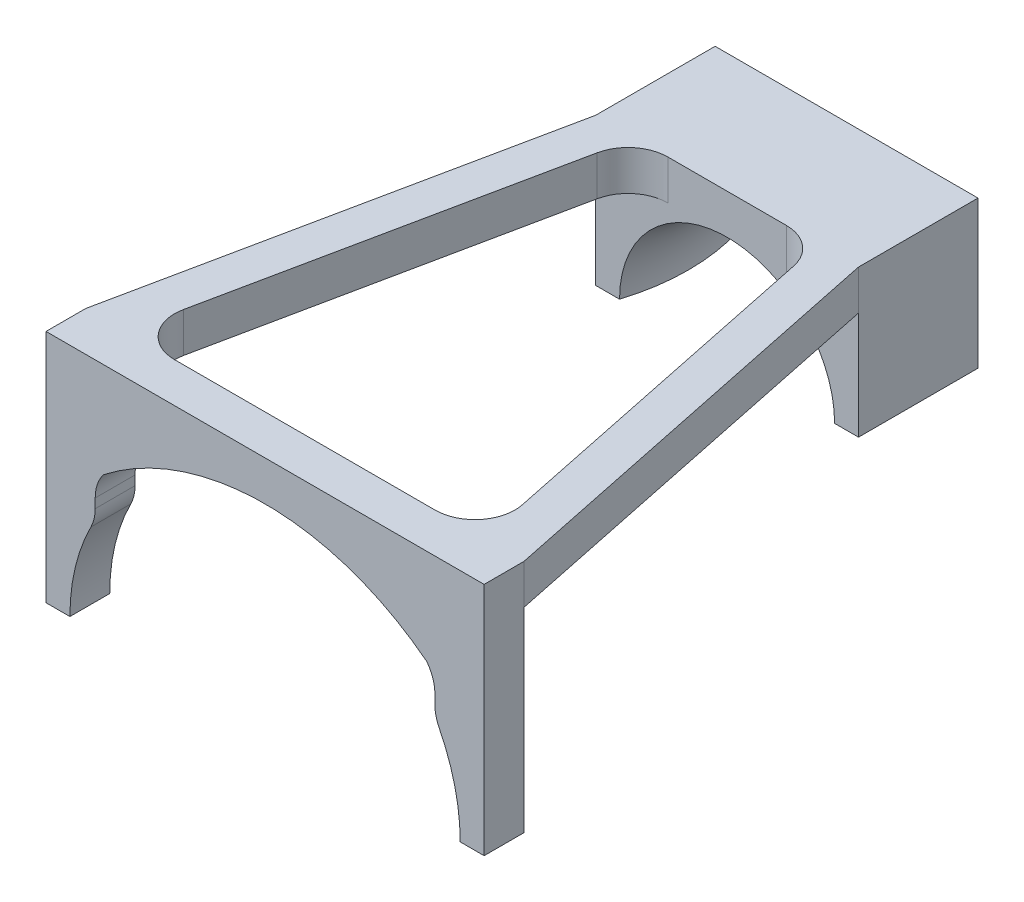
ISO-10303-21;
HEADER;
FILE_DESCRIPTION(('STEP AP214'),'2;1');
FILE_NAME('part.step','',(''),(''),'','','');
FILE_SCHEMA(('AUTOMOTIVE_DESIGN { 1 0 10303 214 1 1 1 1 }'));
ENDSEC;
DATA;
#1=APPLICATION_CONTEXT('core data for automotive mechanical design processes');
#2=APPLICATION_PROTOCOL_DEFINITION('international standard','automotive_design',2000,#1);
#3=PRODUCT_CONTEXT('',#1,'mechanical');
#4=PRODUCT('Part','Part','',(#3));
#5=PRODUCT_RELATED_PRODUCT_CATEGORY('part','',(#4));
#6=PRODUCT_DEFINITION_FORMATION('','',#4);
#7=PRODUCT_DEFINITION_CONTEXT('part definition',#1,'design');
#8=PRODUCT_DEFINITION('design','',#6,#7);
#9=PRODUCT_DEFINITION_SHAPE('','',#8);
#10=(LENGTH_UNIT() NAMED_UNIT(*) SI_UNIT(.MILLI.,.METRE.));
#11=(NAMED_UNIT(*) PLANE_ANGLE_UNIT() SI_UNIT($,.RADIAN.));
#12=(NAMED_UNIT(*) SI_UNIT($,.STERADIAN.) SOLID_ANGLE_UNIT());
#13=UNCERTAINTY_MEASURE_WITH_UNIT(LENGTH_MEASURE(1.E-05),#10,'distance_accuracy_value','');
#14=(GEOMETRIC_REPRESENTATION_CONTEXT(3) GLOBAL_UNCERTAINTY_ASSIGNED_CONTEXT((#13)) GLOBAL_UNIT_ASSIGNED_CONTEXT((#10,
#11,#12)) REPRESENTATION_CONTEXT('',''));
#15=CARTESIAN_POINT('',(0.,0.,0.));
#16=DIRECTION('',(0.,0.,1.));
#17=DIRECTION('',(1.,0.,0.));
#18=AXIS2_PLACEMENT_3D('',#15,#16,#17);
#19=CARTESIAN_POINT('',(0.,0.,0.));
#20=DIRECTION('',(0.,0.,-1.));
#21=DIRECTION('',(-1.,0.,0.));
#22=AXIS2_PLACEMENT_3D('',#19,#20,#21);
#23=PLANE('',#22);
#24=DIRECTION('',(1.,0.,0.));
#25=VECTOR('',#24,1.);
#26=CARTESIAN_POINT('',(-27.5,24.5,0.));
#27=LINE('',#26,#25);
#28=CARTESIAN_POINT('',(-27.5,24.5,0.));
#29=VERTEX_POINT('',#28);
#30=CARTESIAN_POINT('',(-16.3557099612361,24.5,0.));
#31=VERTEX_POINT('',#30);
#32=EDGE_CURVE('E51',#29,#31,#27,.T.);
#33=ORIENTED_EDGE('',*,*,#32,.T.);
#34=DIRECTION('',(0.,1.,0.));
#35=VECTOR('',#34,1.);
#36=CARTESIAN_POINT('',(-16.3557099612361,29.5,0.));
#37=LINE('',#36,#35);
#38=CARTESIAN_POINT('',(-16.3557099612361,29.5,0.));
#39=VERTEX_POINT('',#38);
#40=EDGE_CURVE('E333',#31,#39,#37,.T.);
#41=ORIENTED_EDGE('',*,*,#40,.T.);
#42=DIRECTION('',(-1.,0.,0.));
#43=VECTOR('',#42,1.);
#44=CARTESIAN_POINT('',(-27.5,29.5,0.));
#45=LINE('',#44,#43);
#46=CARTESIAN_POINT('',(16.3557099612361,29.5,0.));
#47=VERTEX_POINT('',#46);
#48=EDGE_CURVE('E352',#47,#39,#45,.T.);
#49=ORIENTED_EDGE('',*,*,#48,.F.);
#50=DIRECTION('',(0.,1.,0.));
#51=VECTOR('',#50,1.);
#52=CARTESIAN_POINT('',(16.3557099612361,24.5,0.));
#53=LINE('',#52,#51);
#54=CARTESIAN_POINT('',(16.3557099612361,24.5,0.));
#55=VERTEX_POINT('',#54);
#56=EDGE_CURVE('E257',#47,#55,#53,.F.);
#57=ORIENTED_EDGE('',*,*,#56,.T.);
#58=DIRECTION('',(1.,0.,0.));
#59=VECTOR('',#58,1.);
#60=CARTESIAN_POINT('',(27.5,24.5,0.));
#61=LINE('',#60,#59);
#62=CARTESIAN_POINT('',(27.5,24.5,0.));
#63=VERTEX_POINT('',#62);
#64=EDGE_CURVE('E58',#55,#63,#61,.T.);
#65=ORIENTED_EDGE('',*,*,#64,.T.);
#66=DIRECTION('',(0.,1.,0.));
#67=VECTOR('',#66,1.);
#68=CARTESIAN_POINT('',(27.5,0.,0.));
#69=LINE('',#68,#67);
#70=CARTESIAN_POINT('',(27.5,0.,0.));
#71=VERTEX_POINT('',#70);
#72=EDGE_CURVE('E254',#71,#63,#69,.T.);
#73=ORIENTED_EDGE('',*,*,#72,.F.);
#74=DIRECTION('',(1.,0.,0.));
#75=VECTOR('',#74,1.);
#76=CARTESIAN_POINT('',(24.5,0.,0.));
#77=LINE('',#76,#75);
#78=CARTESIAN_POINT('',(24.5,0.,0.));
#79=VERTEX_POINT('',#78);
#80=EDGE_CURVE('E267',#79,#71,#77,.T.);
#81=ORIENTED_EDGE('',*,*,#80,.F.);
#82=CARTESIAN_POINT('',(0.,0.,0.));
#83=DIRECTION('',(0.,0.,-1.));
#84=DIRECTION('',(-1.,0.,0.));
#85=AXIS2_PLACEMENT_3D('',#82,#83,#84);
#86=CIRCLE('',#85,24.5);
#87=CARTESIAN_POINT('',(21.8615384615385,11.0599790277683,0.));
#88=VERTEX_POINT('',#87);
#89=EDGE_CURVE('E272',#88,#79,#86,.T.);
#90=ORIENTED_EDGE('',*,*,#89,.F.);
#91=CARTESIAN_POINT('',(26.3230769230769,13.3171176048639,0.));
#92=DIRECTION('',(0.,0.,1.));
#93=DIRECTION('',(1.,0.,0.));
#94=AXIS2_PLACEMENT_3D('',#91,#92,#93);
#95=CIRCLE('',#94,5.);
#96=CARTESIAN_POINT('',(21.3230769230769,13.3171176048639,0.));
#97=VERTEX_POINT('',#96);
#98=EDGE_CURVE('E483',#97,#88,#95,.T.);
#99=ORIENTED_EDGE('',*,*,#98,.F.);
#100=DIRECTION('',(0.,-1.,0.));
#101=VECTOR('',#100,1.);
#102=CARTESIAN_POINT('',(21.3230769230769,14.4852505589068,0.));
#103=LINE('',#102,#101);
#104=CARTESIAN_POINT('',(21.3230769230769,14.4852505589068,0.));
#105=VERTEX_POINT('',#104);
#106=EDGE_CURVE('E481',#105,#97,#103,.T.);
#107=ORIENTED_EDGE('',*,*,#106,.F.);
#108=CARTESIAN_POINT('',(16.3230769230769,14.4852505589068,0.));
#109=DIRECTION('',(0.,0.,-1.));
#110=DIRECTION('',(-1.,0.,0.));
#111=AXIS2_PLACEMENT_3D('',#108,#109,#110);
#112=CIRCLE('',#111,5.);
#113=CARTESIAN_POINT('',(20.2967620018153,17.5200202198551,0.));
#114=VERTEX_POINT('',#113);
#115=EDGE_CURVE('E479',#114,#105,#112,.T.);
#116=ORIENTED_EDGE('',*,*,#115,.F.);
#117=CARTESIAN_POINT('',(0.,-8.5,0.));
#118=DIRECTION('',(0.,0.,-1.));
#119=DIRECTION('',(-1.,0.,0.));
#120=AXIS2_PLACEMENT_3D('',#117,#118,#119);
#121=CIRCLE('',#120,33.);
#122=CARTESIAN_POINT('',(-20.2967620018153,17.5200202198551,0.));
#123=VERTEX_POINT('',#122);
#124=EDGE_CURVE('E477',#123,#114,#121,.T.);
#125=ORIENTED_EDGE('',*,*,#124,.F.);
#126=CARTESIAN_POINT('',(-16.3230769230769,14.4852505589068,0.));
#127=DIRECTION('',(0.,0.,-1.));
#128=DIRECTION('',(1.,0.,0.));
#129=AXIS2_PLACEMENT_3D('',#126,#127,#128);
#130=CIRCLE('',#129,5.);
#131=CARTESIAN_POINT('',(-21.3230769230769,14.4852505589068,0.));
#132=VERTEX_POINT('',#131);
#133=EDGE_CURVE('E474',#132,#123,#130,.T.);
#134=ORIENTED_EDGE('',*,*,#133,.F.);
#135=DIRECTION('',(0.,1.,0.));
#136=VECTOR('',#135,1.);
#137=CARTESIAN_POINT('',(-21.3230769230769,14.4852505589068,0.));
#138=LINE('',#137,#136);
#139=CARTESIAN_POINT('',(-21.3230769230769,13.3171176048639,0.));
#140=VERTEX_POINT('',#139);
#141=EDGE_CURVE('E472',#140,#132,#138,.T.);
#142=ORIENTED_EDGE('',*,*,#141,.F.);
#143=CARTESIAN_POINT('',(-26.3230769230769,13.3171176048639,0.));
#144=DIRECTION('',(0.,0.,1.));
#145=DIRECTION('',(-1.,0.,0.));
#146=AXIS2_PLACEMENT_3D('',#143,#144,#145);
#147=CIRCLE('',#146,5.);
#148=CARTESIAN_POINT('',(-21.8615384615385,11.0599790277683,0.));
#149=VERTEX_POINT('',#148);
#150=EDGE_CURVE('E470',#149,#140,#147,.T.);
#151=ORIENTED_EDGE('',*,*,#150,.F.);
#152=CARTESIAN_POINT('',(0.,0.,0.));
#153=DIRECTION('',(0.,0.,-1.));
#154=DIRECTION('',(1.,0.,0.));
#155=AXIS2_PLACEMENT_3D('',#152,#153,#154);
#156=CIRCLE('',#155,24.5);
#157=CARTESIAN_POINT('',(-24.5,0.,0.));
#158=VERTEX_POINT('',#157);
#159=EDGE_CURVE('E468',#158,#149,#156,.T.);
#160=ORIENTED_EDGE('',*,*,#159,.F.);
#161=DIRECTION('',(1.,0.,0.));
#162=VECTOR('',#161,1.);
#163=CARTESIAN_POINT('',(-24.5,0.,0.));
#164=LINE('',#163,#162);
#165=CARTESIAN_POINT('',(-27.5,0.,0.));
#166=VERTEX_POINT('',#165);
#167=EDGE_CURVE('E466',#166,#158,#164,.T.);
#168=ORIENTED_EDGE('',*,*,#167,.F.);
#169=DIRECTION('',(0.,-1.,0.));
#170=VECTOR('',#169,1.);
#171=CARTESIAN_POINT('',(-27.5,0.,0.));
#172=LINE('',#171,#170);
#173=EDGE_CURVE('E357',#29,#166,#172,.T.);
#174=ORIENTED_EDGE('',*,*,#173,.F.);
#175=EDGE_LOOP('',(#33,#41,#49,#57,#65,#73,#81,#90,#99,#107,#116,#125,#134,#142,#151,#160,#168,#174));
#176=FACE_BOUND('',#175,.T.);
#177=ADVANCED_FACE('F36',(#176),#23,.T.);
#178=CARTESIAN_POINT('',(-27.5,29.5,5.));
#179=DIRECTION('',(0.,-1.,0.));
#180=DIRECTION('',(0.,0.,-1.));
#181=AXIS2_PLACEMENT_3D('',#178,#179,#180);
#182=PLANE('',#181);
#183=DIRECTION('',(-1.,0.,0.));
#184=VECTOR('',#183,1.);
#185=CARTESIAN_POINT('',(-16.5,29.5,-53.));
#186=LINE('',#185,#184);
#187=CARTESIAN_POINT('',(7.4311816593493,29.5,-53.));
#188=VERTEX_POINT('',#187);
#189=CARTESIAN_POINT('',(-7.4311816593493,29.5,-53.));
#190=VERTEX_POINT('',#189);
#191=EDGE_CURVE('E405',#188,#190,#186,.T.);
#192=ORIENTED_EDGE('',*,*,#191,.F.);
#193=CARTESIAN_POINT('',(7.4311816593493,29.5,-48.));
#194=DIRECTION('',(0.,-1.,0.));
#195=DIRECTION('',(0.,0.,-1.));
#196=AXIS2_PLACEMENT_3D('',#193,#194,#195);
#197=CIRCLE('',#196,5.);
#198=CARTESIAN_POINT('',(12.326850846683,29.5,-49.0160822841636));
#199=VERTEX_POINT('',#198);
#200=EDGE_CURVE('E339',#188,#199,#197,.T.);
#201=ORIENTED_EDGE('',*,*,#200,.T.);
#202=DIRECTION('',(0.203216456832721,0.,0.979133837466745));
#203=VECTOR('',#202,1.);
#204=CARTESIAN_POINT('',(22.5,29.5,0.));
#205=LINE('',#204,#203);
#206=CARTESIAN_POINT('',(21.2513791485698,29.5,-6.0160822841636));
#207=VERTEX_POINT('',#206);
#208=EDGE_CURVE('E259',#199,#207,#205,.T.);
#209=ORIENTED_EDGE('',*,*,#208,.T.);
#210=CARTESIAN_POINT('',(16.3557099612361,29.5,-5.));
#211=DIRECTION('',(0.,-1.,0.));
#212=DIRECTION('',(0.,0.,-1.));
#213=AXIS2_PLACEMENT_3D('',#210,#211,#212);
#214=CIRCLE('',#213,5.);
#215=EDGE_CURVE('E44',#207,#47,#214,.T.);
#216=ORIENTED_EDGE('',*,*,#215,.T.);
#217=ORIENTED_EDGE('',*,*,#48,.T.);
#218=CARTESIAN_POINT('',(-16.3557099612361,29.5,-5.));
#219=DIRECTION('',(0.,-1.,0.));
#220=DIRECTION('',(0.,0.,-1.));
#221=AXIS2_PLACEMENT_3D('',#218,#219,#220);
#222=CIRCLE('',#221,5.);
#223=CARTESIAN_POINT('',(-21.2513791485698,29.5,-6.0160822841636));
#224=VERTEX_POINT('',#223);
#225=EDGE_CURVE('E343',#39,#224,#222,.T.);
#226=ORIENTED_EDGE('',*,*,#225,.T.);
#227=DIRECTION('',(0.203216456832721,0.,-0.979133837466745));
#228=VECTOR('',#227,1.);
#229=CARTESIAN_POINT('',(-22.5,29.5,0.));
#230=LINE('',#229,#228);
#231=CARTESIAN_POINT('',(-12.326850846683,29.5,-49.0160822841636));
#232=VERTEX_POINT('',#231);
#233=EDGE_CURVE('E415',#224,#232,#230,.T.);
#234=ORIENTED_EDGE('',*,*,#233,.T.);
#235=CARTESIAN_POINT('',(-7.4311816593493,29.5,-48.));
#236=DIRECTION('',(0.,-1.,0.));
#237=DIRECTION('',(0.,0.,-1.));
#238=AXIS2_PLACEMENT_3D('',#235,#236,#237);
#239=CIRCLE('',#238,5.);
#240=EDGE_CURVE('E335',#232,#190,#239,.T.);
#241=ORIENTED_EDGE('',*,*,#240,.T.);
#242=EDGE_LOOP('',(#192,#201,#209,#216,#217,#226,#234,#241));
#243=FACE_BOUND('',#242,.T.);
#244=DIRECTION('',(0.,0.,-1.));
#245=VECTOR('',#244,1.);
#246=CARTESIAN_POINT('',(27.5,29.5,5.));
#247=LINE('',#246,#245);
#248=CARTESIAN_POINT('',(27.5,29.5,5.));
#249=VERTEX_POINT('',#248);
#250=CARTESIAN_POINT('',(27.5,29.5,0.));
#251=VERTEX_POINT('',#250);
#252=EDGE_CURVE('E276',#249,#251,#247,.T.);
#253=ORIENTED_EDGE('',*,*,#252,.T.);
#254=DIRECTION('',(-0.203216456832721,0.,-0.979133837466745));
#255=VECTOR('',#254,1.);
#256=CARTESIAN_POINT('',(27.5,29.5,0.));
#257=LINE('',#256,#255);
#258=CARTESIAN_POINT('',(16.5,29.5,-53.));
#259=VERTEX_POINT('',#258);
#260=EDGE_CURVE('E239',#251,#259,#257,.T.);
#261=ORIENTED_EDGE('',*,*,#260,.T.);
#262=DIRECTION('',(0.,0.,1.));
#263=VECTOR('',#262,1.);
#264=CARTESIAN_POINT('',(16.5,29.5,-68.));
#265=LINE('',#264,#263);
#266=CARTESIAN_POINT('',(16.5,29.5,-68.));
#267=VERTEX_POINT('',#266);
#268=EDGE_CURVE('E419',#267,#259,#265,.T.);
#269=ORIENTED_EDGE('',*,*,#268,.F.);
#270=DIRECTION('',(-1.,0.,0.));
#271=VECTOR('',#270,1.);
#272=CARTESIAN_POINT('',(-16.5,29.5,-68.));
#273=LINE('',#272,#271);
#274=CARTESIAN_POINT('',(-16.5,29.5,-68.));
#275=VERTEX_POINT('',#274);
#276=EDGE_CURVE('E387',#267,#275,#273,.T.);
#277=ORIENTED_EDGE('',*,*,#276,.T.);
#278=DIRECTION('',(0.,0.,1.));
#279=VECTOR('',#278,1.);
#280=CARTESIAN_POINT('',(-16.5,29.5,-68.));
#281=LINE('',#280,#279);
#282=CARTESIAN_POINT('',(-16.5,29.5,-53.));
#283=VERTEX_POINT('',#282);
#284=EDGE_CURVE('E416',#275,#283,#281,.T.);
#285=ORIENTED_EDGE('',*,*,#284,.T.);
#286=DIRECTION('',(-0.203216456832721,0.,0.979133837466745));
#287=VECTOR('',#286,1.);
#288=CARTESIAN_POINT('',(-27.5,29.5,0.));
#289=LINE('',#288,#287);
#290=CARTESIAN_POINT('',(-27.5,29.5,0.));
#291=VERTEX_POINT('',#290);
#292=EDGE_CURVE('E424',#283,#291,#289,.T.);
#293=ORIENTED_EDGE('',*,*,#292,.T.);
#294=DIRECTION('',(0.,0.,-1.));
#295=VECTOR('',#294,1.);
#296=CARTESIAN_POINT('',(-27.5,29.5,5.));
#297=LINE('',#296,#295);
#298=CARTESIAN_POINT('',(-27.5,29.5,5.));
#299=VERTEX_POINT('',#298);
#300=EDGE_CURVE('E313',#299,#291,#297,.T.);
#301=ORIENTED_EDGE('',*,*,#300,.F.);
#302=DIRECTION('',(-1.,0.,0.));
#303=VECTOR('',#302,1.);
#304=CARTESIAN_POINT('',(-27.5,29.5,5.));
#305=LINE('',#304,#303);
#306=EDGE_CURVE('E266',#249,#299,#305,.T.);
#307=ORIENTED_EDGE('',*,*,#306,.F.);
#308=EDGE_LOOP('',(#253,#261,#269,#277,#285,#293,#301,#307));
#309=FACE_BOUND('',#308,.T.);
#310=ADVANCED_FACE('F350',(#243,#309),#182,.F.);
#311=CARTESIAN_POINT('',(-27.5,0.,5.));
#312=DIRECTION('',(1.,0.,0.));
#313=DIRECTION('',(0.,0.,-1.));
#314=AXIS2_PLACEMENT_3D('',#311,#312,#313);
#315=PLANE('',#314);
#316=EDGE_CURVE('E463',#291,#29,#172,.T.);
#317=ORIENTED_EDGE('',*,*,#316,.T.);
#318=ORIENTED_EDGE('',*,*,#173,.T.);
#319=DIRECTION('',(0.,0.,-1.));
#320=VECTOR('',#319,1.);
#321=CARTESIAN_POINT('',(-27.5,0.,5.));
#322=LINE('',#321,#320);
#323=CARTESIAN_POINT('',(-27.5,0.,5.));
#324=VERTEX_POINT('',#323);
#325=EDGE_CURVE('E310',#324,#166,#322,.T.);
#326=ORIENTED_EDGE('',*,*,#325,.F.);
#327=DIRECTION('',(0.,-1.,0.));
#328=VECTOR('',#327,1.);
#329=CARTESIAN_POINT('',(-27.5,0.,5.));
#330=LINE('',#329,#328);
#331=EDGE_CURVE('E270',#299,#324,#330,.T.);
#332=ORIENTED_EDGE('',*,*,#331,.F.);
#333=ORIENTED_EDGE('',*,*,#300,.T.);
#334=EDGE_LOOP('',(#317,#318,#326,#332,#333));
#335=FACE_BOUND('',#334,.T.);
#336=ADVANCED_FACE('F540',(#335),#315,.F.);
#337=CARTESIAN_POINT('',(-24.5,0.,5.));
#338=DIRECTION('',(0.,1.,0.));
#339=DIRECTION('',(-1.,0.,0.));
#340=AXIS2_PLACEMENT_3D('',#337,#338,#339);
#341=PLANE('',#340);
#342=ORIENTED_EDGE('',*,*,#167,.T.);
#343=DIRECTION('',(0.,0.,-1.));
#344=VECTOR('',#343,1.);
#345=CARTESIAN_POINT('',(-24.5,0.,5.));
#346=LINE('',#345,#344);
#347=CARTESIAN_POINT('',(-24.5,0.,5.));
#348=VERTEX_POINT('',#347);
#349=EDGE_CURVE('E307',#348,#158,#346,.T.);
#350=ORIENTED_EDGE('',*,*,#349,.F.);
#351=DIRECTION('',(1.,0.,0.));
#352=VECTOR('',#351,1.);
#353=CARTESIAN_POINT('',(-24.5,0.,5.));
#354=LINE('',#353,#352);
#355=EDGE_CURVE('E440',#324,#348,#354,.T.);
#356=ORIENTED_EDGE('',*,*,#355,.F.);
#357=ORIENTED_EDGE('',*,*,#325,.T.);
#358=EDGE_LOOP('',(#342,#350,#356,#357));
#359=FACE_BOUND('',#358,.T.);
#360=ADVANCED_FACE('F537',(#359),#341,.F.);
#361=CARTESIAN_POINT('',(0.,0.,5.));
#362=DIRECTION('',(0.,0.,-1.));
#363=DIRECTION('',(-1.,0.,0.));
#364=AXIS2_PLACEMENT_3D('',#361,#362,#363);
#365=CYLINDRICAL_SURFACE('',#364,24.5);
#366=ORIENTED_EDGE('',*,*,#159,.T.);
#367=DIRECTION('',(0.,0.,-1.));
#368=VECTOR('',#367,1.);
#369=CARTESIAN_POINT('',(-21.8615384615385,11.0599790277683,5.));
#370=LINE('',#369,#368);
#371=CARTESIAN_POINT('',(-21.8615384615385,11.0599790277683,5.));
#372=VERTEX_POINT('',#371);
#373=EDGE_CURVE('E304',#372,#149,#370,.T.);
#374=ORIENTED_EDGE('',*,*,#373,.F.);
#375=CARTESIAN_POINT('',(0.,0.,5.));
#376=DIRECTION('',(0.,0.,-1.));
#377=DIRECTION('',(1.,0.,0.));
#378=AXIS2_PLACEMENT_3D('',#375,#376,#377);
#379=CIRCLE('',#378,24.5);
#380=EDGE_CURVE('E442',#348,#372,#379,.T.);
#381=ORIENTED_EDGE('',*,*,#380,.F.);
#382=ORIENTED_EDGE('',*,*,#349,.T.);
#383=EDGE_LOOP('',(#366,#374,#381,#382));
#384=FACE_BOUND('',#383,.T.);
#385=ADVANCED_FACE('F533',(#384),#365,.F.);
#386=CARTESIAN_POINT('',(-26.3230769230769,13.3171176048639,5.));
#387=DIRECTION('',(0.,0.,-1.));
#388=DIRECTION('',(-1.,0.,0.));
#389=AXIS2_PLACEMENT_3D('',#386,#387,#388);
#390=CYLINDRICAL_SURFACE('',#389,5.);
#391=ORIENTED_EDGE('',*,*,#150,.T.);
#392=DIRECTION('',(0.,0.,-1.));
#393=VECTOR('',#392,1.);
#394=CARTESIAN_POINT('',(-21.3230769230769,13.3171176048639,5.));
#395=LINE('',#394,#393);
#396=CARTESIAN_POINT('',(-21.3230769230769,13.3171176048639,5.));
#397=VERTEX_POINT('',#396);
#398=EDGE_CURVE('E301',#397,#140,#395,.T.);
#399=ORIENTED_EDGE('',*,*,#398,.F.);
#400=CARTESIAN_POINT('',(-26.3230769230769,13.3171176048639,5.));
#401=DIRECTION('',(0.,0.,1.));
#402=DIRECTION('',(-1.,0.,0.));
#403=AXIS2_PLACEMENT_3D('',#400,#401,#402);
#404=CIRCLE('',#403,5.);
#405=EDGE_CURVE('E444',#372,#397,#404,.T.);
#406=ORIENTED_EDGE('',*,*,#405,.F.);
#407=ORIENTED_EDGE('',*,*,#373,.T.);
#408=EDGE_LOOP('',(#391,#399,#406,#407));
#409=FACE_BOUND('',#408,.T.);
#410=ADVANCED_FACE('F528',(#409),#390,.T.);
#411=CARTESIAN_POINT('',(-21.3230769230769,14.4852505589068,5.));
#412=DIRECTION('',(-1.,0.,0.));
#413=DIRECTION('',(0.,-1.,0.));
#414=AXIS2_PLACEMENT_3D('',#411,#412,#413);
#415=PLANE('',#414);
#416=ORIENTED_EDGE('',*,*,#141,.T.);
#417=DIRECTION('',(0.,0.,-1.));
#418=VECTOR('',#417,1.);
#419=CARTESIAN_POINT('',(-21.3230769230769,14.4852505589068,5.));
#420=LINE('',#419,#418);
#421=CARTESIAN_POINT('',(-21.3230769230769,14.4852505589068,5.));
#422=VERTEX_POINT('',#421);
#423=EDGE_CURVE('E298',#422,#132,#420,.T.);
#424=ORIENTED_EDGE('',*,*,#423,.F.);
#425=DIRECTION('',(0.,1.,0.));
#426=VECTOR('',#425,1.);
#427=CARTESIAN_POINT('',(-21.3230769230769,14.4852505589068,5.));
#428=LINE('',#427,#426);
#429=EDGE_CURVE('E446',#397,#422,#428,.T.);
#430=ORIENTED_EDGE('',*,*,#429,.F.);
#431=ORIENTED_EDGE('',*,*,#398,.T.);
#432=EDGE_LOOP('',(#416,#424,#430,#431));
#433=FACE_BOUND('',#432,.T.);
#434=ADVANCED_FACE('F522',(#433),#415,.F.);
#435=CARTESIAN_POINT('',(-16.3230769230769,14.4852505589068,5.));
#436=DIRECTION('',(0.,0.,-1.));
#437=DIRECTION('',(-1.,0.,0.));
#438=AXIS2_PLACEMENT_3D('',#435,#436,#437);
#439=CYLINDRICAL_SURFACE('',#438,5.);
#440=ORIENTED_EDGE('',*,*,#133,.T.);
#441=DIRECTION('',(0.,0.,-1.));
#442=VECTOR('',#441,1.);
#443=CARTESIAN_POINT('',(-20.2967620018153,17.5200202198551,5.));
#444=LINE('',#443,#442);
#445=CARTESIAN_POINT('',(-20.2967620018153,17.5200202198551,5.));
#446=VERTEX_POINT('',#445);
#447=EDGE_CURVE('E295',#446,#123,#444,.T.);
#448=ORIENTED_EDGE('',*,*,#447,.F.);
#449=CARTESIAN_POINT('',(-16.3230769230769,14.4852505589068,5.));
#450=DIRECTION('',(0.,0.,-1.));
#451=DIRECTION('',(1.,0.,0.));
#452=AXIS2_PLACEMENT_3D('',#449,#450,#451);
#453=CIRCLE('',#452,5.);
#454=EDGE_CURVE('E448',#422,#446,#453,.T.);
#455=ORIENTED_EDGE('',*,*,#454,.F.);
#456=ORIENTED_EDGE('',*,*,#423,.T.);
#457=EDGE_LOOP('',(#440,#448,#455,#456));
#458=FACE_BOUND('',#457,.T.);
#459=ADVANCED_FACE('F517',(#458),#439,.F.);
#460=CARTESIAN_POINT('',(0.,-8.5,5.));
#461=DIRECTION('',(0.,0.,-1.));
#462=DIRECTION('',(-1.,0.,0.));
#463=AXIS2_PLACEMENT_3D('',#460,#461,#462);
#464=CYLINDRICAL_SURFACE('',#463,33.);
#465=ORIENTED_EDGE('',*,*,#124,.T.);
#466=DIRECTION('',(0.,0.,-1.));
#467=VECTOR('',#466,1.);
#468=CARTESIAN_POINT('',(20.2967620018153,17.5200202198551,5.));
#469=LINE('',#468,#467);
#470=CARTESIAN_POINT('',(20.2967620018153,17.5200202198551,5.));
#471=VERTEX_POINT('',#470);
#472=EDGE_CURVE('E292',#471,#114,#469,.T.);
#473=ORIENTED_EDGE('',*,*,#472,.F.);
#474=CARTESIAN_POINT('',(0.,-8.5,5.));
#475=DIRECTION('',(0.,0.,-1.));
#476=DIRECTION('',(1.,0.,0.));
#477=AXIS2_PLACEMENT_3D('',#474,#475,#476);
#478=CIRCLE('',#477,33.);
#479=EDGE_CURVE('E450',#446,#471,#478,.T.);
#480=ORIENTED_EDGE('',*,*,#479,.F.);
#481=ORIENTED_EDGE('',*,*,#447,.T.);
#482=EDGE_LOOP('',(#465,#473,#480,#481));
#483=FACE_BOUND('',#482,.T.);
#484=ADVANCED_FACE('F512',(#483),#464,.F.);
#485=CARTESIAN_POINT('',(16.3230769230769,14.4852505589068,5.));
#486=DIRECTION('',(0.,0.,-1.));
#487=DIRECTION('',(-1.,0.,0.));
#488=AXIS2_PLACEMENT_3D('',#485,#486,#487);
#489=CYLINDRICAL_SURFACE('',#488,5.);
#490=ORIENTED_EDGE('',*,*,#115,.T.);
#491=DIRECTION('',(0.,0.,-1.));
#492=VECTOR('',#491,1.);
#493=CARTESIAN_POINT('',(21.3230769230769,14.4852505589068,5.));
#494=LINE('',#493,#492);
#495=CARTESIAN_POINT('',(21.3230769230769,14.4852505589068,5.));
#496=VERTEX_POINT('',#495);
#497=EDGE_CURVE('E289',#496,#105,#494,.T.);
#498=ORIENTED_EDGE('',*,*,#497,.F.);
#499=CARTESIAN_POINT('',(16.3230769230769,14.4852505589068,5.));
#500=DIRECTION('',(0.,0.,-1.));
#501=DIRECTION('',(-1.,0.,0.));
#502=AXIS2_PLACEMENT_3D('',#499,#500,#501);
#503=CIRCLE('',#502,5.);
#504=EDGE_CURVE('E452',#471,#496,#503,.T.);
#505=ORIENTED_EDGE('',*,*,#504,.F.);
#506=ORIENTED_EDGE('',*,*,#472,.T.);
#507=EDGE_LOOP('',(#490,#498,#505,#506));
#508=FACE_BOUND('',#507,.T.);
#509=ADVANCED_FACE('F508',(#508),#489,.F.);
#510=CARTESIAN_POINT('',(21.3230769230769,14.4852505589068,5.));
#511=DIRECTION('',(1.,0.,0.));
#512=DIRECTION('',(0.,1.,0.));
#513=AXIS2_PLACEMENT_3D('',#510,#511,#512);
#514=PLANE('',#513);
#515=ORIENTED_EDGE('',*,*,#106,.T.);
#516=DIRECTION('',(0.,0.,-1.));
#517=VECTOR('',#516,1.);
#518=CARTESIAN_POINT('',(21.3230769230769,13.3171176048639,5.));
#519=LINE('',#518,#517);
#520=CARTESIAN_POINT('',(21.3230769230769,13.3171176048639,5.));
#521=VERTEX_POINT('',#520);
#522=EDGE_CURVE('E286',#521,#97,#519,.T.);
#523=ORIENTED_EDGE('',*,*,#522,.F.);
#524=DIRECTION('',(0.,-1.,0.));
#525=VECTOR('',#524,1.);
#526=CARTESIAN_POINT('',(21.3230769230769,14.4852505589068,5.));
#527=LINE('',#526,#525);
#528=EDGE_CURVE('E454',#496,#521,#527,.T.);
#529=ORIENTED_EDGE('',*,*,#528,.F.);
#530=ORIENTED_EDGE('',*,*,#497,.T.);
#531=EDGE_LOOP('',(#515,#523,#529,#530));
#532=FACE_BOUND('',#531,.T.);
#533=ADVANCED_FACE('F504',(#532),#514,.F.);
#534=CARTESIAN_POINT('',(26.3230769230769,13.3171176048639,5.));
#535=DIRECTION('',(0.,0.,-1.));
#536=DIRECTION('',(-1.,0.,0.));
#537=AXIS2_PLACEMENT_3D('',#534,#535,#536);
#538=CYLINDRICAL_SURFACE('',#537,5.);
#539=ORIENTED_EDGE('',*,*,#98,.T.);
#540=DIRECTION('',(0.,0.,-1.));
#541=VECTOR('',#540,1.);
#542=CARTESIAN_POINT('',(21.8615384615385,11.0599790277683,5.));
#543=LINE('',#542,#541);
#544=CARTESIAN_POINT('',(21.8615384615385,11.0599790277683,5.));
#545=VERTEX_POINT('',#544);
#546=EDGE_CURVE('E283',#545,#88,#543,.T.);
#547=ORIENTED_EDGE('',*,*,#546,.F.);
#548=CARTESIAN_POINT('',(26.3230769230769,13.3171176048639,5.));
#549=DIRECTION('',(0.,0.,1.));
#550=DIRECTION('',(1.,0.,0.));
#551=AXIS2_PLACEMENT_3D('',#548,#549,#550);
#552=CIRCLE('',#551,5.);
#553=EDGE_CURVE('E456',#521,#545,#552,.T.);
#554=ORIENTED_EDGE('',*,*,#553,.F.);
#555=ORIENTED_EDGE('',*,*,#522,.T.);
#556=EDGE_LOOP('',(#539,#547,#554,#555));
#557=FACE_BOUND('',#556,.T.);
#558=ADVANCED_FACE('F500',(#557),#538,.T.);
#559=CARTESIAN_POINT('',(0.,0.,5.));
#560=DIRECTION('',(0.,0.,-1.));
#561=DIRECTION('',(-1.,0.,0.));
#562=AXIS2_PLACEMENT_3D('',#559,#560,#561);
#563=CYLINDRICAL_SURFACE('',#562,24.5);
#564=ORIENTED_EDGE('',*,*,#89,.T.);
#565=DIRECTION('',(0.,0.,-1.));
#566=VECTOR('',#565,1.);
#567=CARTESIAN_POINT('',(24.5,0.,5.));
#568=LINE('',#567,#566);
#569=CARTESIAN_POINT('',(24.5,0.,5.));
#570=VERTEX_POINT('',#569);
#571=EDGE_CURVE('E280',#570,#79,#568,.T.);
#572=ORIENTED_EDGE('',*,*,#571,.F.);
#573=CARTESIAN_POINT('',(0.,0.,5.));
#574=DIRECTION('',(0.,0.,-1.));
#575=DIRECTION('',(-1.,0.,0.));
#576=AXIS2_PLACEMENT_3D('',#573,#574,#575);
#577=CIRCLE('',#576,24.5);
#578=EDGE_CURVE('E458',#545,#570,#577,.T.);
#579=ORIENTED_EDGE('',*,*,#578,.F.);
#580=ORIENTED_EDGE('',*,*,#546,.T.);
#581=EDGE_LOOP('',(#564,#572,#579,#580));
#582=FACE_BOUND('',#581,.T.);
#583=ADVANCED_FACE('F487',(#582),#563,.F.);
#584=CARTESIAN_POINT('',(24.5,0.,5.));
#585=DIRECTION('',(0.,1.,0.));
#586=DIRECTION('',(-1.,0.,0.));
#587=AXIS2_PLACEMENT_3D('',#584,#585,#586);
#588=PLANE('',#587);
#589=ORIENTED_EDGE('',*,*,#80,.T.);
#590=DIRECTION('',(0.,0.,-1.));
#591=VECTOR('',#590,1.);
#592=CARTESIAN_POINT('',(27.5,0.,5.));
#593=LINE('',#592,#591);
#594=CARTESIAN_POINT('',(27.5,0.,5.));
#595=VERTEX_POINT('',#594);
#596=EDGE_CURVE('E265',#595,#71,#593,.T.);
#597=ORIENTED_EDGE('',*,*,#596,.F.);
#598=DIRECTION('',(1.,0.,0.));
#599=VECTOR('',#598,1.);
#600=CARTESIAN_POINT('',(24.5,0.,5.));
#601=LINE('',#600,#599);
#602=EDGE_CURVE('E460',#570,#595,#601,.T.);
#603=ORIENTED_EDGE('',*,*,#602,.F.);
#604=ORIENTED_EDGE('',*,*,#571,.T.);
#605=EDGE_LOOP('',(#589,#597,#603,#604));
#606=FACE_BOUND('',#605,.T.);
#607=ADVANCED_FACE('F493',(#606),#588,.F.);
#608=CARTESIAN_POINT('',(27.5,0.,5.));
#609=DIRECTION('',(-1.,0.,0.));
#610=DIRECTION('',(0.,0.,1.));
#611=AXIS2_PLACEMENT_3D('',#608,#609,#610);
#612=PLANE('',#611);
#613=ORIENTED_EDGE('',*,*,#72,.T.);
#614=DIRECTION('',(0.,1.,0.));
#615=VECTOR('',#614,1.);
#616=CARTESIAN_POINT('',(27.5,24.5,0.));
#617=LINE('',#616,#615);
#618=EDGE_CURVE('E234',#63,#251,#617,.T.);
#619=ORIENTED_EDGE('',*,*,#618,.T.);
#620=ORIENTED_EDGE('',*,*,#252,.F.);
#621=DIRECTION('',(0.,1.,0.));
#622=VECTOR('',#621,1.);
#623=CARTESIAN_POINT('',(27.5,0.,5.));
#624=LINE('',#623,#622);
#625=EDGE_CURVE('E278',#595,#249,#624,.T.);
#626=ORIENTED_EDGE('',*,*,#625,.F.);
#627=ORIENTED_EDGE('',*,*,#596,.T.);
#628=EDGE_LOOP('',(#613,#619,#620,#626,#627));
#629=FACE_BOUND('',#628,.T.);
#630=ADVANCED_FACE('F262',(#629),#612,.F.);
#631=CARTESIAN_POINT('',(0.,0.,5.));
#632=DIRECTION('',(0.,0.,-1.));
#633=DIRECTION('',(-1.,0.,0.));
#634=AXIS2_PLACEMENT_3D('',#631,#632,#633);
#635=PLANE('',#634);
#636=ORIENTED_EDGE('',*,*,#306,.T.);
#637=ORIENTED_EDGE('',*,*,#331,.T.);
#638=ORIENTED_EDGE('',*,*,#355,.T.);
#639=ORIENTED_EDGE('',*,*,#380,.T.);
#640=ORIENTED_EDGE('',*,*,#405,.T.);
#641=ORIENTED_EDGE('',*,*,#429,.T.);
#642=ORIENTED_EDGE('',*,*,#454,.T.);
#643=ORIENTED_EDGE('',*,*,#479,.T.);
#644=ORIENTED_EDGE('',*,*,#504,.T.);
#645=ORIENTED_EDGE('',*,*,#528,.T.);
#646=ORIENTED_EDGE('',*,*,#553,.T.);
#647=ORIENTED_EDGE('',*,*,#578,.T.);
#648=ORIENTED_EDGE('',*,*,#602,.T.);
#649=ORIENTED_EDGE('',*,*,#625,.T.);
#650=EDGE_LOOP('',(#636,#637,#638,#639,#640,#641,#642,#643,#644,#645,#646,#647,#648,#649));
#651=FACE_BOUND('',#650,.T.);
#652=ADVANCED_FACE('F495',(#651),#635,.F.);
#653=CARTESIAN_POINT('',(-27.5,24.5,0.));
#654=DIRECTION('',(-0.979133837466745,0.,-0.203216456832721));
#655=DIRECTION('',(-0.203216456832721,0.,0.979133837466745));
#656=AXIS2_PLACEMENT_3D('',#653,#654,#655);
#657=PLANE('',#656);
#658=ORIENTED_EDGE('',*,*,#292,.F.);
#659=DIRECTION('',(0.,1.,0.));
#660=VECTOR('',#659,1.);
#661=CARTESIAN_POINT('',(-16.5,24.5,-53.));
#662=LINE('',#661,#660);
#663=CARTESIAN_POINT('',(-16.5,24.5,-53.));
#664=VERTEX_POINT('',#663);
#665=EDGE_CURVE('E358',#664,#283,#662,.T.);
#666=ORIENTED_EDGE('',*,*,#665,.F.);
#667=DIRECTION('',(-0.203216456832721,0.,0.979133837466745));
#668=VECTOR('',#667,1.);
#669=CARTESIAN_POINT('',(-27.5,24.5,0.));
#670=LINE('',#669,#668);
#671=EDGE_CURVE('E430',#664,#29,#670,.T.);
#672=ORIENTED_EDGE('',*,*,#671,.T.);
#673=ORIENTED_EDGE('',*,*,#316,.F.);
#674=EDGE_LOOP('',(#658,#666,#672,#673));
#675=FACE_BOUND('',#674,.T.);
#676=ADVANCED_FACE('F543',(#675),#657,.T.);
#677=CARTESIAN_POINT('',(-22.5,24.5,0.));
#678=DIRECTION('',(0.979133837466745,0.,0.203216456832721));
#679=DIRECTION('',(0.203216456832721,0.,-0.979133837466745));
#680=AXIS2_PLACEMENT_3D('',#677,#678,#679);
#681=PLANE('',#680);
#682=DIRECTION('',(0.203216456832721,0.,-0.979133837466745));
#683=VECTOR('',#682,1.);
#684=CARTESIAN_POINT('',(-22.5,24.5,0.));
#685=LINE('',#684,#683);
#686=CARTESIAN_POINT('',(-21.2513791485698,24.5,-6.0160822841636));
#687=VERTEX_POINT('',#686);
#688=CARTESIAN_POINT('',(-12.326850846683,24.5,-49.0160822841636));
#689=VERTEX_POINT('',#688);
#690=EDGE_CURVE('E423',#687,#689,#685,.T.);
#691=ORIENTED_EDGE('',*,*,#690,.T.);
#692=DIRECTION('',(0.,1.,0.));
#693=VECTOR('',#692,1.);
#694=CARTESIAN_POINT('',(-12.326850846683,29.5,-49.0160822841636));
#695=LINE('',#694,#693);
#696=EDGE_CURVE('E318',#689,#232,#695,.T.);
#697=ORIENTED_EDGE('',*,*,#696,.T.);
#698=ORIENTED_EDGE('',*,*,#233,.F.);
#699=DIRECTION('',(0.,1.,0.));
#700=VECTOR('',#699,1.);
#701=CARTESIAN_POINT('',(-21.2513791485698,24.5,-6.0160822841636));
#702=LINE('',#701,#700);
#703=EDGE_CURVE('E316',#224,#687,#702,.F.);
#704=ORIENTED_EDGE('',*,*,#703,.T.);
#705=EDGE_LOOP('',(#691,#697,#698,#704));
#706=FACE_BOUND('',#705,.T.);
#707=ADVANCED_FACE('F564',(#706),#681,.T.);
#708=CARTESIAN_POINT('',(0.,24.5,0.));
#709=DIRECTION('',(0.,1.,0.));
#710=DIRECTION('',(0.,0.,1.));
#711=AXIS2_PLACEMENT_3D('',#708,#709,#710);
#712=PLANE('',#711);
#713=ORIENTED_EDGE('',*,*,#32,.F.);
#714=ORIENTED_EDGE('',*,*,#671,.F.);
#715=DIRECTION('',(-1.,0.,0.));
#716=VECTOR('',#715,1.);
#717=CARTESIAN_POINT('',(-11.5,24.5,-53.));
#718=LINE('',#717,#716);
#719=CARTESIAN_POINT('',(-7.4311816593493,24.5,-53.));
#720=VERTEX_POINT('',#719);
#721=EDGE_CURVE('E427',#720,#664,#718,.T.);
#722=ORIENTED_EDGE('',*,*,#721,.F.);
#723=CARTESIAN_POINT('',(-7.4311816593493,24.5,-48.));
#724=DIRECTION('',(0.,1.,0.));
#725=DIRECTION('',(0.,0.,1.));
#726=AXIS2_PLACEMENT_3D('',#723,#724,#725);
#727=CIRCLE('',#726,5.);
#728=EDGE_CURVE('E337',#720,#689,#727,.T.);
#729=ORIENTED_EDGE('',*,*,#728,.T.);
#730=ORIENTED_EDGE('',*,*,#690,.F.);
#731=CARTESIAN_POINT('',(-16.3557099612361,24.5,-5.));
#732=DIRECTION('',(0.,1.,0.));
#733=DIRECTION('',(0.,0.,1.));
#734=AXIS2_PLACEMENT_3D('',#731,#732,#733);
#735=CIRCLE('',#734,5.);
#736=EDGE_CURVE('E345',#687,#31,#735,.T.);
#737=ORIENTED_EDGE('',*,*,#736,.T.);
#738=EDGE_LOOP('',(#713,#714,#722,#729,#730,#737));
#739=FACE_BOUND('',#738,.T.);
#740=ADVANCED_FACE('F556',(#739),#712,.F.);
#741=CARTESIAN_POINT('',(0.,11.,-53.));
#742=DIRECTION('',(0.,0.,1.));
#743=DIRECTION('',(1.,0.,0.));
#744=AXIS2_PLACEMENT_3D('',#741,#742,#743);
#745=PLANE('',#744);
#746=ORIENTED_EDGE('',*,*,#191,.T.);
#747=DIRECTION('',(0.,1.,0.));
#748=VECTOR('',#747,1.);
#749=CARTESIAN_POINT('',(-7.4311816593493,24.5,-53.));
#750=LINE('',#749,#748);
#751=EDGE_CURVE('E324',#190,#720,#750,.F.);
#752=ORIENTED_EDGE('',*,*,#751,.T.);
#753=ORIENTED_EDGE('',*,*,#721,.T.);
#754=DIRECTION('',(0.,-1.,0.));
#755=VECTOR('',#754,1.);
#756=CARTESIAN_POINT('',(-16.5,11.,-53.));
#757=LINE('',#756,#755);
#758=CARTESIAN_POINT('',(-16.5,11.,-53.));
#759=VERTEX_POINT('',#758);
#760=EDGE_CURVE('E408',#664,#759,#757,.T.);
#761=ORIENTED_EDGE('',*,*,#760,.T.);
#762=DIRECTION('',(1.,0.,0.));
#763=VECTOR('',#762,1.);
#764=CARTESIAN_POINT('',(-16.5,11.,-53.));
#765=LINE('',#764,#763);
#766=CARTESIAN_POINT('',(-13.5,10.9999999999999,-53.));
#767=VERTEX_POINT('',#766);
#768=EDGE_CURVE('E381',#759,#767,#765,.T.);
#769=ORIENTED_EDGE('',*,*,#768,.T.);
#770=CARTESIAN_POINT('',(0.,11.,-53.));
#771=DIRECTION('',(0.,0.,-1.));
#772=DIRECTION('',(1.,0.,0.));
#773=AXIS2_PLACEMENT_3D('',#770,#771,#772);
#774=CIRCLE('',#773,13.5);
#775=CARTESIAN_POINT('',(13.5,11.,-53.));
#776=VERTEX_POINT('',#775);
#777=EDGE_CURVE('E377',#767,#776,#774,.T.);
#778=ORIENTED_EDGE('',*,*,#777,.T.);
#779=DIRECTION('',(1.,0.,0.));
#780=VECTOR('',#779,1.);
#781=CARTESIAN_POINT('',(16.5,11.,-53.));
#782=LINE('',#781,#780);
#783=CARTESIAN_POINT('',(16.5,11.,-53.));
#784=VERTEX_POINT('',#783);
#785=EDGE_CURVE('E399',#776,#784,#782,.T.);
#786=ORIENTED_EDGE('',*,*,#785,.T.);
#787=DIRECTION('',(0.,1.,0.));
#788=VECTOR('',#787,1.);
#789=CARTESIAN_POINT('',(16.5,11.,-53.));
#790=LINE('',#789,#788);
#791=CARTESIAN_POINT('',(16.5,24.5,-53.));
#792=VERTEX_POINT('',#791);
#793=EDGE_CURVE('E402',#784,#792,#790,.T.);
#794=ORIENTED_EDGE('',*,*,#793,.T.);
#795=DIRECTION('',(-1.,0.,0.));
#796=VECTOR('',#795,1.);
#797=CARTESIAN_POINT('',(11.5,24.5,-53.));
#798=LINE('',#797,#796);
#799=CARTESIAN_POINT('',(7.4311816593493,24.5,-53.));
#800=VERTEX_POINT('',#799);
#801=EDGE_CURVE('E250',#792,#800,#798,.T.);
#802=ORIENTED_EDGE('',*,*,#801,.T.);
#803=DIRECTION('',(0.,1.,0.));
#804=VECTOR('',#803,1.);
#805=CARTESIAN_POINT('',(7.4311816593493,29.5,-53.));
#806=LINE('',#805,#804);
#807=EDGE_CURVE('E321',#800,#188,#806,.T.);
#808=ORIENTED_EDGE('',*,*,#807,.T.);
#809=EDGE_LOOP('',(#746,#752,#753,#761,#769,#778,#786,#794,#802,#808));
#810=FACE_BOUND('',#809,.T.);
#811=ADVANCED_FACE('F552',(#810),#745,.T.);
#812=CARTESIAN_POINT('',(-16.5,11.,-68.));
#813=DIRECTION('',(0.,-1.,0.));
#814=DIRECTION('',(0.,0.,-1.));
#815=AXIS2_PLACEMENT_3D('',#812,#813,#814);
#816=PLANE('',#815);
#817=ORIENTED_EDGE('',*,*,#768,.F.);
#818=DIRECTION('',(0.,0.,1.));
#819=VECTOR('',#818,1.);
#820=CARTESIAN_POINT('',(-16.5,11.,-68.));
#821=LINE('',#820,#819);
#822=CARTESIAN_POINT('',(-16.5,11.,-68.));
#823=VERTEX_POINT('',#822);
#824=EDGE_CURVE('E412',#823,#759,#821,.T.);
#825=ORIENTED_EDGE('',*,*,#824,.F.);
#826=DIRECTION('',(1.,0.,0.));
#827=VECTOR('',#826,1.);
#828=CARTESIAN_POINT('',(-16.5,11.,-68.));
#829=LINE('',#828,#827);
#830=CARTESIAN_POINT('',(-13.5,10.9999999999999,-68.));
#831=VERTEX_POINT('',#830);
#832=EDGE_CURVE('E393',#823,#831,#829,.T.);
#833=ORIENTED_EDGE('',*,*,#832,.T.);
#834=CARTESIAN_POINT('',(-37.3484800354236,10.9999999999997,-60.5));
#835=DIRECTION('',(0.,1.,0.));
#836=DIRECTION('',(0.,0.,-1.));
#837=AXIS2_PLACEMENT_3D('',#834,#835,#836);
#838=CIRCLE('',#837,25.);
#839=EDGE_CURVE('E375',#767,#831,#838,.T.);
#840=ORIENTED_EDGE('',*,*,#839,.F.);
#841=EDGE_LOOP('',(#817,#825,#833,#840));
#842=FACE_BOUND('',#841,.T.);
#843=ADVANCED_FACE('F693',(#842),#816,.T.);
#844=CARTESIAN_POINT('',(-16.5,11.,-68.));
#845=DIRECTION('',(-1.,0.,0.));
#846=DIRECTION('',(0.,0.,1.));
#847=AXIS2_PLACEMENT_3D('',#844,#845,#846);
#848=PLANE('',#847);
#849=ORIENTED_EDGE('',*,*,#665,.T.);
#850=ORIENTED_EDGE('',*,*,#284,.F.);
#851=DIRECTION('',(0.,-1.,0.));
#852=VECTOR('',#851,1.);
#853=CARTESIAN_POINT('',(-16.5,11.,-68.));
#854=LINE('',#853,#852);
#855=EDGE_CURVE('E390',#275,#823,#854,.T.);
#856=ORIENTED_EDGE('',*,*,#855,.T.);
#857=ORIENTED_EDGE('',*,*,#824,.T.);
#858=ORIENTED_EDGE('',*,*,#760,.F.);
#859=EDGE_LOOP('',(#849,#850,#856,#857,#858));
#860=FACE_BOUND('',#859,.T.);
#861=ADVANCED_FACE('F550',(#860),#848,.T.);
#862=CARTESIAN_POINT('',(16.5,11.,-68.));
#863=DIRECTION('',(1.,0.,0.));
#864=DIRECTION('',(0.,0.,-1.));
#865=AXIS2_PLACEMENT_3D('',#862,#863,#864);
#866=PLANE('',#865);
#867=ORIENTED_EDGE('',*,*,#793,.F.);
#868=DIRECTION('',(0.,0.,1.));
#869=VECTOR('',#868,1.);
#870=CARTESIAN_POINT('',(16.5,11.,-68.));
#871=LINE('',#870,#869);
#872=CARTESIAN_POINT('',(16.5,11.,-68.));
#873=VERTEX_POINT('',#872);
#874=EDGE_CURVE('E396',#873,#784,#871,.T.);
#875=ORIENTED_EDGE('',*,*,#874,.F.);
#876=DIRECTION('',(0.,1.,0.));
#877=VECTOR('',#876,1.);
#878=CARTESIAN_POINT('',(16.5,11.,-68.));
#879=LINE('',#878,#877);
#880=EDGE_CURVE('E384',#873,#267,#879,.T.);
#881=ORIENTED_EDGE('',*,*,#880,.T.);
#882=ORIENTED_EDGE('',*,*,#268,.T.);
#883=DIRECTION('',(0.,1.,0.));
#884=VECTOR('',#883,1.);
#885=CARTESIAN_POINT('',(16.5,24.5,-53.));
#886=LINE('',#885,#884);
#887=EDGE_CURVE('E244',#792,#259,#886,.T.);
#888=ORIENTED_EDGE('',*,*,#887,.F.);
#889=EDGE_LOOP('',(#867,#875,#881,#882,#888));
#890=FACE_BOUND('',#889,.T.);
#891=ADVANCED_FACE('F707',(#890),#866,.T.);
#892=CARTESIAN_POINT('',(16.5,11.,-68.));
#893=DIRECTION('',(0.,-1.,0.));
#894=DIRECTION('',(0.,0.,-1.));
#895=AXIS2_PLACEMENT_3D('',#892,#893,#894);
#896=PLANE('',#895);
#897=ORIENTED_EDGE('',*,*,#785,.F.);
#898=CARTESIAN_POINT('',(37.3484800354236,11.,-60.5));
#899=DIRECTION('',(0.,-1.,0.));
#900=DIRECTION('',(0.,0.,-1.));
#901=AXIS2_PLACEMENT_3D('',#898,#899,#900);
#902=CIRCLE('',#901,25.);
#903=CARTESIAN_POINT('',(13.5,11.,-68.));
#904=VERTEX_POINT('',#903);
#905=EDGE_CURVE('E371',#776,#904,#902,.T.);
#906=ORIENTED_EDGE('',*,*,#905,.T.);
#907=DIRECTION('',(1.,0.,0.));
#908=VECTOR('',#907,1.);
#909=CARTESIAN_POINT('',(16.5,11.,-68.));
#910=LINE('',#909,#908);
#911=EDGE_CURVE('E380',#904,#873,#910,.T.);
#912=ORIENTED_EDGE('',*,*,#911,.T.);
#913=ORIENTED_EDGE('',*,*,#874,.T.);
#914=EDGE_LOOP('',(#897,#906,#912,#913));
#915=FACE_BOUND('',#914,.T.);
#916=ADVANCED_FACE('F714',(#915),#896,.T.);
#917=CARTESIAN_POINT('',(0.,11.,-68.));
#918=DIRECTION('',(0.,0.,1.));
#919=DIRECTION('',(1.,0.,0.));
#920=AXIS2_PLACEMENT_3D('',#917,#918,#919);
#921=PLANE('',#920);
#922=CARTESIAN_POINT('',(0.,11.,-68.));
#923=DIRECTION('',(0.,0.,-1.));
#924=DIRECTION('',(1.,0.,0.));
#925=AXIS2_PLACEMENT_3D('',#922,#923,#924);
#926=CIRCLE('',#925,13.5);
#927=EDGE_CURVE('E378',#831,#904,#926,.T.);
#928=ORIENTED_EDGE('',*,*,#927,.F.);
#929=ORIENTED_EDGE('',*,*,#832,.F.);
#930=ORIENTED_EDGE('',*,*,#855,.F.);
#931=ORIENTED_EDGE('',*,*,#276,.F.);
#932=ORIENTED_EDGE('',*,*,#880,.F.);
#933=ORIENTED_EDGE('',*,*,#911,.F.);
#934=EDGE_LOOP('',(#928,#929,#930,#931,#932,#933));
#935=FACE_BOUND('',#934,.T.);
#936=ADVANCED_FACE('F722',(#935),#921,.F.);
#937=CARTESIAN_POINT('',(0.,11.,-60.5));
#938=DIRECTION('',(0.,0.,-1.));
#939=DIRECTION('',(-1.,0.,0.));
#940=AXIS2_PLACEMENT_3D('',#937,#938,#939);
#941=TOROIDAL_SURFACE('',#940,37.3484800354236,25.);
#942=ORIENTED_EDGE('',*,*,#927,.T.);
#943=ORIENTED_EDGE('',*,*,#905,.F.);
#944=ORIENTED_EDGE('',*,*,#777,.F.);
#945=ORIENTED_EDGE('',*,*,#839,.T.);
#946=EDGE_LOOP('',(#942,#943,#944,#945));
#947=FACE_BOUND('',#946,.T.);
#948=ADVANCED_FACE('F730',(#947),#941,.T.);
#949=CARTESIAN_POINT('',(22.5,24.5,0.));
#950=DIRECTION('',(-0.979133837466745,0.,0.203216456832721));
#951=DIRECTION('',(0.203216456832721,0.,0.979133837466745));
#952=AXIS2_PLACEMENT_3D('',#949,#950,#951);
#953=PLANE('',#952);
#954=ORIENTED_EDGE('',*,*,#208,.F.);
#955=DIRECTION('',(0.,1.,0.));
#956=VECTOR('',#955,1.);
#957=CARTESIAN_POINT('',(12.326850846683,24.5,-49.0160822841636));
#958=LINE('',#957,#956);
#959=CARTESIAN_POINT('',(12.326850846683,24.5,-49.0160822841636));
#960=VERTEX_POINT('',#959);
#961=EDGE_CURVE('E330',#199,#960,#958,.F.);
#962=ORIENTED_EDGE('',*,*,#961,.T.);
#963=DIRECTION('',(0.203216456832721,0.,0.979133837466745));
#964=VECTOR('',#963,1.);
#965=CARTESIAN_POINT('',(22.5,24.5,0.));
#966=LINE('',#965,#964);
#967=CARTESIAN_POINT('',(21.2513791485698,24.5,-6.0160822841636));
#968=VERTEX_POINT('',#967);
#969=EDGE_CURVE('E245',#960,#968,#966,.T.);
#970=ORIENTED_EDGE('',*,*,#969,.T.);
#971=DIRECTION('',(0.,1.,0.));
#972=VECTOR('',#971,1.);
#973=CARTESIAN_POINT('',(21.2513791485698,29.5,-6.0160822841636));
#974=LINE('',#973,#972);
#975=EDGE_CURVE('E327',#968,#207,#974,.T.);
#976=ORIENTED_EDGE('',*,*,#975,.T.);
#977=EDGE_LOOP('',(#954,#962,#970,#976));
#978=FACE_BOUND('',#977,.T.);
#979=ADVANCED_FACE('F364',(#978),#953,.T.);
#980=CARTESIAN_POINT('',(27.5,24.5,0.));
#981=DIRECTION('',(0.979133837466745,0.,-0.203216456832721));
#982=DIRECTION('',(-0.203216456832721,0.,-0.979133837466745));
#983=AXIS2_PLACEMENT_3D('',#980,#981,#982);
#984=PLANE('',#983);
#985=ORIENTED_EDGE('',*,*,#260,.F.);
#986=ORIENTED_EDGE('',*,*,#618,.F.);
#987=DIRECTION('',(-0.203216456832721,0.,-0.979133837466745));
#988=VECTOR('',#987,1.);
#989=CARTESIAN_POINT('',(27.5,24.5,0.));
#990=LINE('',#989,#988);
#991=EDGE_CURVE('E237',#63,#792,#990,.T.);
#992=ORIENTED_EDGE('',*,*,#991,.T.);
#993=ORIENTED_EDGE('',*,*,#887,.T.);
#994=EDGE_LOOP('',(#985,#986,#992,#993));
#995=FACE_BOUND('',#994,.T.);
#996=ADVANCED_FACE('F235',(#995),#984,.T.);
#997=CARTESIAN_POINT('',(0.,24.5,0.));
#998=DIRECTION('',(0.,-1.,0.));
#999=DIRECTION('',(0.,0.,-1.));
#1000=AXIS2_PLACEMENT_3D('',#997,#998,#999);
#1001=PLANE('',#1000);
#1002=ORIENTED_EDGE('',*,*,#64,.F.);
#1003=CARTESIAN_POINT('',(16.3557099612361,24.5,-5.));
#1004=DIRECTION('',(0.,-1.,0.));
#1005=DIRECTION('',(0.,0.,-1.));
#1006=AXIS2_PLACEMENT_3D('',#1003,#1004,#1005);
#1007=CIRCLE('',#1006,5.);
#1008=EDGE_CURVE('E11',#55,#968,#1007,.F.);
#1009=ORIENTED_EDGE('',*,*,#1008,.T.);
#1010=ORIENTED_EDGE('',*,*,#969,.F.);
#1011=CARTESIAN_POINT('',(7.4311816593493,24.5,-48.));
#1012=DIRECTION('',(0.,-1.,0.));
#1013=DIRECTION('',(0.,0.,-1.));
#1014=AXIS2_PLACEMENT_3D('',#1011,#1012,#1013);
#1015=CIRCLE('',#1014,5.);
#1016=EDGE_CURVE('E341',#960,#800,#1015,.F.);
#1017=ORIENTED_EDGE('',*,*,#1016,.T.);
#1018=ORIENTED_EDGE('',*,*,#801,.F.);
#1019=ORIENTED_EDGE('',*,*,#991,.F.);
#1020=EDGE_LOOP('',(#1002,#1009,#1010,#1017,#1018,#1019));
#1021=FACE_BOUND('',#1020,.T.);
#1022=ADVANCED_FACE('F248',(#1021),#1001,.T.);
#1023=CARTESIAN_POINT('',(-7.4311816593493,24.5,-48.));
#1024=DIRECTION('',(0.,-1.,0.));
#1025=DIRECTION('',(0.,0.,-1.));
#1026=AXIS2_PLACEMENT_3D('',#1023,#1024,#1025);
#1027=CYLINDRICAL_SURFACE('',#1026,5.);
#1028=ORIENTED_EDGE('',*,*,#728,.F.);
#1029=ORIENTED_EDGE('',*,*,#751,.F.);
#1030=ORIENTED_EDGE('',*,*,#240,.F.);
#1031=ORIENTED_EDGE('',*,*,#696,.F.);
#1032=EDGE_LOOP('',(#1028,#1029,#1030,#1031));
#1033=FACE_BOUND('',#1032,.T.);
#1034=ADVANCED_FACE('F567',(#1033),#1027,.F.);
#1035=CARTESIAN_POINT('',(7.4311816593493,11.,-48.));
#1036=DIRECTION('',(0.,-1.,0.));
#1037=DIRECTION('',(0.,0.,-1.));
#1038=AXIS2_PLACEMENT_3D('',#1035,#1036,#1037);
#1039=CYLINDRICAL_SURFACE('',#1038,5.);
#1040=ORIENTED_EDGE('',*,*,#1016,.F.);
#1041=ORIENTED_EDGE('',*,*,#961,.F.);
#1042=ORIENTED_EDGE('',*,*,#200,.F.);
#1043=ORIENTED_EDGE('',*,*,#807,.F.);
#1044=EDGE_LOOP('',(#1040,#1041,#1042,#1043));
#1045=FACE_BOUND('',#1044,.T.);
#1046=ADVANCED_FACE('F570',(#1045),#1039,.F.);
#1047=CARTESIAN_POINT('',(-16.3557099612361,0.,-5.));
#1048=DIRECTION('',(0.,-1.,0.));
#1049=DIRECTION('',(0.,0.,-1.));
#1050=AXIS2_PLACEMENT_3D('',#1047,#1048,#1049);
#1051=CYLINDRICAL_SURFACE('',#1050,5.);
#1052=ORIENTED_EDGE('',*,*,#736,.F.);
#1053=ORIENTED_EDGE('',*,*,#703,.F.);
#1054=ORIENTED_EDGE('',*,*,#225,.F.);
#1055=ORIENTED_EDGE('',*,*,#40,.F.);
#1056=EDGE_LOOP('',(#1052,#1053,#1054,#1055));
#1057=FACE_BOUND('',#1056,.T.);
#1058=ADVANCED_FACE('F561',(#1057),#1051,.F.);
#1059=CARTESIAN_POINT('',(16.3557099612361,24.5,-5.));
#1060=DIRECTION('',(0.,-1.,0.));
#1061=DIRECTION('',(0.,0.,-1.));
#1062=AXIS2_PLACEMENT_3D('',#1059,#1060,#1061);
#1063=CYLINDRICAL_SURFACE('',#1062,5.);
#1064=ORIENTED_EDGE('',*,*,#1008,.F.);
#1065=ORIENTED_EDGE('',*,*,#56,.F.);
#1066=ORIENTED_EDGE('',*,*,#215,.F.);
#1067=ORIENTED_EDGE('',*,*,#975,.F.);
#1068=EDGE_LOOP('',(#1064,#1065,#1066,#1067));
#1069=FACE_BOUND('',#1068,.T.);
#1070=ADVANCED_FACE('F38',(#1069),#1063,.F.);
#1071=CLOSED_SHELL('',(#177,#310,#336,#360,#385,#410,#434,#459,#484,#509,#533,#558,#583,#607,
#630,#652,#676,#707,#740,#811,#843,#861,#891,#916,#936,#948,#979,#996,#1022,#1034,#1046,#1058,#1070));
#1072=MANIFOLD_SOLID_BREP('B2',#1071);
#1073=ADVANCED_BREP_SHAPE_REPRESENTATION('',(#18,#1072),#14);
#1074=SHAPE_DEFINITION_REPRESENTATION(#9,#1073);
ENDSEC;
END-ISO-10303-21;
